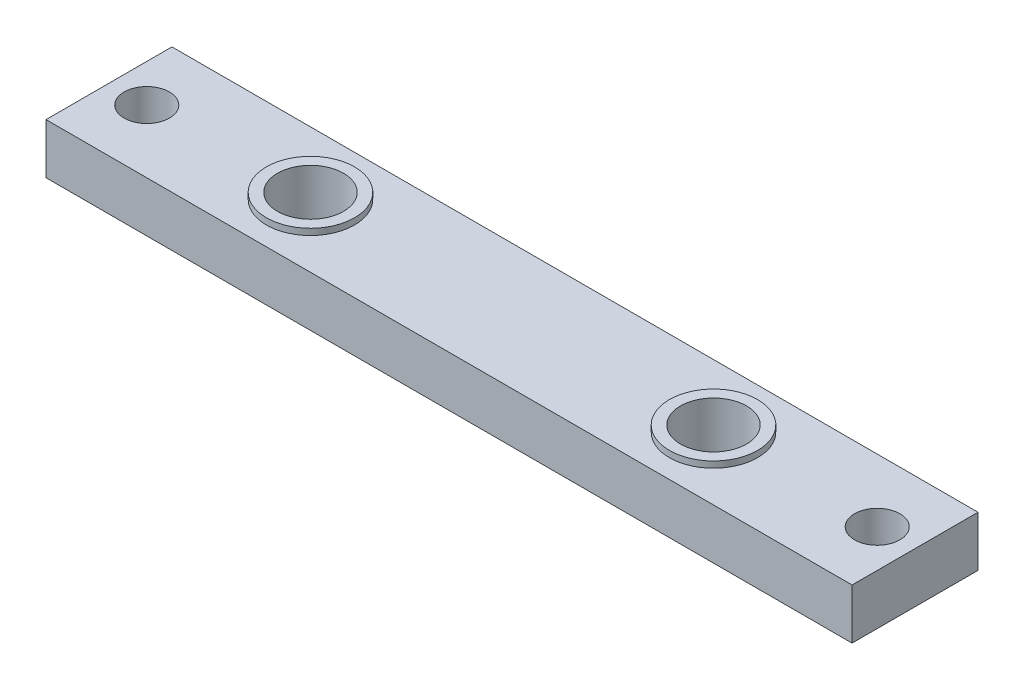
ISO-10303-21;
HEADER;
FILE_DESCRIPTION(('STEP AP214'),'2;1');
FILE_NAME('part.step','',(''),(''),'','','');
FILE_SCHEMA(('AUTOMOTIVE_DESIGN { 1 0 10303 214 1 1 1 1 }'));
ENDSEC;
DATA;
#1=APPLICATION_CONTEXT('core data for automotive mechanical design processes');
#2=APPLICATION_PROTOCOL_DEFINITION('international standard','automotive_design',2000,#1);
#3=PRODUCT_CONTEXT('',#1,'mechanical');
#4=PRODUCT('Part','Part','',(#3));
#5=PRODUCT_RELATED_PRODUCT_CATEGORY('part','',(#4));
#6=PRODUCT_DEFINITION_FORMATION('','',#4);
#7=PRODUCT_DEFINITION_CONTEXT('part definition',#1,'design');
#8=PRODUCT_DEFINITION('design','',#6,#7);
#9=PRODUCT_DEFINITION_SHAPE('','',#8);
#10=(LENGTH_UNIT() NAMED_UNIT(*) SI_UNIT(.MILLI.,.METRE.));
#11=(NAMED_UNIT(*) PLANE_ANGLE_UNIT() SI_UNIT($,.RADIAN.));
#12=(NAMED_UNIT(*) SI_UNIT($,.STERADIAN.) SOLID_ANGLE_UNIT());
#13=UNCERTAINTY_MEASURE_WITH_UNIT(LENGTH_MEASURE(1.E-05),#10,'distance_accuracy_value','');
#14=(GEOMETRIC_REPRESENTATION_CONTEXT(3) GLOBAL_UNCERTAINTY_ASSIGNED_CONTEXT((#13)) GLOBAL_UNIT_ASSIGNED_CONTEXT((#10,
#11,#12)) REPRESENTATION_CONTEXT('',''));
#15=CARTESIAN_POINT('',(0.,0.,0.));
#16=DIRECTION('',(0.,0.,1.));
#17=DIRECTION('',(1.,0.,0.));
#18=AXIS2_PLACEMENT_3D('',#15,#16,#17);
#19=CARTESIAN_POINT('',(0.,4.,0.));
#20=DIRECTION('',(0.,-1.,0.));
#21=DIRECTION('',(0.,0.,-1.));
#22=AXIS2_PLACEMENT_3D('',#19,#20,#21);
#23=PLANE('',#22);
#24=CARTESIAN_POINT('',(48.,4.,-5.));
#25=DIRECTION('',(0.,-1.,0.));
#26=DIRECTION('',(0.,0.,-1.));
#27=AXIS2_PLACEMENT_3D('',#24,#25,#26);
#28=CIRCLE('',#27,3.5);
#29=CARTESIAN_POINT('',(48.,4.,-8.5));
#30=VERTEX_POINT('',#29);
#31=EDGE_CURVE('E248',#30,#30,#28,.T.);
#32=ORIENTED_EDGE('',*,*,#31,.T.);
#33=EDGE_LOOP('',(#32));
#34=FACE_BOUND('',#33,.T.);
#35=CARTESIAN_POINT('',(16.,4.,-5.));
#36=DIRECTION('',(0.,-1.,0.));
#37=DIRECTION('',(0.,0.,-1.));
#38=AXIS2_PLACEMENT_3D('',#35,#36,#37);
#39=CIRCLE('',#38,3.5);
#40=CARTESIAN_POINT('',(16.,4.,-8.5));
#41=VERTEX_POINT('',#40);
#42=EDGE_CURVE('E237',#41,#41,#39,.T.);
#43=ORIENTED_EDGE('',*,*,#42,.T.);
#44=EDGE_LOOP('',(#43));
#45=FACE_BOUND('',#44,.T.);
#46=CARTESIAN_POINT('',(61.,4.,-5.));
#47=DIRECTION('',(0.,-1.,0.));
#48=DIRECTION('',(0.,0.,-1.));
#49=AXIS2_PLACEMENT_3D('',#46,#47,#48);
#50=CIRCLE('',#49,1.8);
#51=CARTESIAN_POINT('',(61.,4.,-6.8));
#52=VERTEX_POINT('',#51);
#53=EDGE_CURVE('E225',#52,#52,#50,.T.);
#54=ORIENTED_EDGE('',*,*,#53,.T.);
#55=EDGE_LOOP('',(#54));
#56=FACE_BOUND('',#55,.T.);
#57=DIRECTION('',(0.,0.,-1.));
#58=VECTOR('',#57,1.);
#59=CARTESIAN_POINT('',(0.,4.,0.));
#60=LINE('',#59,#58);
#61=CARTESIAN_POINT('',(0.,4.,0.));
#62=VERTEX_POINT('',#61);
#63=CARTESIAN_POINT('',(0.,4.,-10.));
#64=VERTEX_POINT('',#63);
#65=EDGE_CURVE('E166',#62,#64,#60,.T.);
#66=ORIENTED_EDGE('',*,*,#65,.F.);
#67=DIRECTION('',(1.,0.,0.));
#68=VECTOR('',#67,1.);
#69=CARTESIAN_POINT('',(0.,4.,0.));
#70=LINE('',#69,#68);
#71=CARTESIAN_POINT('',(64.,4.,0.));
#72=VERTEX_POINT('',#71);
#73=EDGE_CURVE('E156',#62,#72,#70,.T.);
#74=ORIENTED_EDGE('',*,*,#73,.T.);
#75=DIRECTION('',(0.,0.,-1.));
#76=VECTOR('',#75,1.);
#77=CARTESIAN_POINT('',(64.,4.,0.));
#78=LINE('',#77,#76);
#79=CARTESIAN_POINT('',(64.,4.,-10.));
#80=VERTEX_POINT('',#79);
#81=EDGE_CURVE('E151',#72,#80,#78,.T.);
#82=ORIENTED_EDGE('',*,*,#81,.T.);
#83=DIRECTION('',(1.,0.,0.));
#84=VECTOR('',#83,1.);
#85=CARTESIAN_POINT('',(0.,4.,-10.));
#86=LINE('',#85,#84);
#87=EDGE_CURVE('E155',#64,#80,#86,.T.);
#88=ORIENTED_EDGE('',*,*,#87,.F.);
#89=EDGE_LOOP('',(#66,#74,#82,#88));
#90=FACE_BOUND('',#89,.T.);
#91=CARTESIAN_POINT('',(3.,4.,-5.));
#92=DIRECTION('',(0.,1.,0.));
#93=DIRECTION('',(0.,0.,1.));
#94=AXIS2_PLACEMENT_3D('',#91,#92,#93);
#95=CIRCLE('',#94,1.8);
#96=CARTESIAN_POINT('',(3.,4.,-3.2));
#97=VERTEX_POINT('',#96);
#98=EDGE_CURVE('E176',#97,#97,#95,.T.);
#99=ORIENTED_EDGE('',*,*,#98,.F.);
#100=EDGE_LOOP('',(#99));
#101=FACE_BOUND('',#100,.T.);
#102=ADVANCED_FACE('F105',(#34,#45,#56,#90,#101),#23,.F.);
#103=CARTESIAN_POINT('',(0.,0.,0.));
#104=DIRECTION('',(0.,-1.,0.));
#105=DIRECTION('',(0.,0.,-1.));
#106=AXIS2_PLACEMENT_3D('',#103,#104,#105);
#107=PLANE('',#106);
#108=CARTESIAN_POINT('',(48.,0.,-5.));
#109=DIRECTION('',(0.,-1.,0.));
#110=DIRECTION('',(0.,0.,-1.));
#111=AXIS2_PLACEMENT_3D('',#108,#109,#110);
#112=CIRCLE('',#111,2.625);
#113=CARTESIAN_POINT('',(48.,0.,-7.625));
#114=VERTEX_POINT('',#113);
#115=EDGE_CURVE('E231',#114,#114,#112,.T.);
#116=ORIENTED_EDGE('',*,*,#115,.F.);
#117=EDGE_LOOP('',(#116));
#118=FACE_BOUND('',#117,.T.);
#119=CARTESIAN_POINT('',(61.,0.,-5.));
#120=DIRECTION('',(0.,-1.,0.));
#121=DIRECTION('',(0.,0.,-1.));
#122=AXIS2_PLACEMENT_3D('',#119,#120,#121);
#123=CIRCLE('',#122,1.8);
#124=CARTESIAN_POINT('',(61.,0.,-6.8));
#125=VERTEX_POINT('',#124);
#126=EDGE_CURVE('E228',#125,#125,#123,.T.);
#127=ORIENTED_EDGE('',*,*,#126,.F.);
#128=EDGE_LOOP('',(#127));
#129=FACE_BOUND('',#128,.T.);
#130=CARTESIAN_POINT('',(3.,0.,-5.));
#131=DIRECTION('',(0.,1.,0.));
#132=DIRECTION('',(0.,0.,1.));
#133=AXIS2_PLACEMENT_3D('',#130,#131,#132);
#134=CIRCLE('',#133,1.8);
#135=CARTESIAN_POINT('',(3.,0.,-3.2));
#136=VERTEX_POINT('',#135);
#137=EDGE_CURVE('E220',#136,#136,#134,.T.);
#138=ORIENTED_EDGE('',*,*,#137,.T.);
#139=EDGE_LOOP('',(#138));
#140=FACE_BOUND('',#139,.T.);
#141=DIRECTION('',(0.,0.,-1.));
#142=VECTOR('',#141,1.);
#143=CARTESIAN_POINT('',(0.,0.,0.));
#144=LINE('',#143,#142);
#145=CARTESIAN_POINT('',(0.,0.,0.));
#146=VERTEX_POINT('',#145);
#147=CARTESIAN_POINT('',(0.,0.,-10.));
#148=VERTEX_POINT('',#147);
#149=EDGE_CURVE('E172',#146,#148,#144,.T.);
#150=ORIENTED_EDGE('',*,*,#149,.T.);
#151=DIRECTION('',(1.,0.,0.));
#152=VECTOR('',#151,1.);
#153=CARTESIAN_POINT('',(0.,0.,-10.));
#154=LINE('',#153,#152);
#155=CARTESIAN_POINT('',(64.,0.,-10.));
#156=VERTEX_POINT('',#155);
#157=EDGE_CURVE('E175',#148,#156,#154,.T.);
#158=ORIENTED_EDGE('',*,*,#157,.T.);
#159=DIRECTION('',(0.,0.,-1.));
#160=VECTOR('',#159,1.);
#161=CARTESIAN_POINT('',(64.,0.,0.));
#162=LINE('',#161,#160);
#163=CARTESIAN_POINT('',(64.,0.,0.));
#164=VERTEX_POINT('',#163);
#165=EDGE_CURVE('E163',#164,#156,#162,.T.);
#166=ORIENTED_EDGE('',*,*,#165,.F.);
#167=DIRECTION('',(1.,0.,0.));
#168=VECTOR('',#167,1.);
#169=CARTESIAN_POINT('',(0.,0.,0.));
#170=LINE('',#169,#168);
#171=EDGE_CURVE('E139',#146,#164,#170,.T.);
#172=ORIENTED_EDGE('',*,*,#171,.F.);
#173=EDGE_LOOP('',(#150,#158,#166,#172));
#174=FACE_BOUND('',#173,.T.);
#175=CARTESIAN_POINT('',(16.,0.,-5.));
#176=DIRECTION('',(0.,1.,0.));
#177=DIRECTION('',(0.,0.,1.));
#178=AXIS2_PLACEMENT_3D('',#175,#176,#177);
#179=CIRCLE('',#178,2.625);
#180=CARTESIAN_POINT('',(16.,0.,-2.375));
#181=VERTEX_POINT('',#180);
#182=EDGE_CURVE('E222',#181,#181,#179,.T.);
#183=ORIENTED_EDGE('',*,*,#182,.T.);
#184=EDGE_LOOP('',(#183));
#185=FACE_BOUND('',#184,.T.);
#186=ADVANCED_FACE('F181',(#118,#129,#140,#174,#185),#107,.T.);
#187=CARTESIAN_POINT('',(0.,4.,0.));
#188=DIRECTION('',(-1.,0.,0.));
#189=DIRECTION('',(0.,0.,1.));
#190=AXIS2_PLACEMENT_3D('',#187,#188,#189);
#191=PLANE('',#190);
#192=ORIENTED_EDGE('',*,*,#149,.F.);
#193=DIRECTION('',(0.,-1.,0.));
#194=VECTOR('',#193,1.);
#195=CARTESIAN_POINT('',(0.,4.,0.));
#196=LINE('',#195,#194);
#197=EDGE_CURVE('E12',#62,#146,#196,.T.);
#198=ORIENTED_EDGE('',*,*,#197,.F.);
#199=ORIENTED_EDGE('',*,*,#65,.T.);
#200=DIRECTION('',(0.,-1.,0.));
#201=VECTOR('',#200,1.);
#202=CARTESIAN_POINT('',(0.,4.,-10.));
#203=LINE('',#202,#201);
#204=EDGE_CURVE('E109',#64,#148,#203,.T.);
#205=ORIENTED_EDGE('',*,*,#204,.T.);
#206=EDGE_LOOP('',(#192,#198,#199,#205));
#207=FACE_BOUND('',#206,.T.);
#208=ADVANCED_FACE('F107',(#207),#191,.T.);
#209=CARTESIAN_POINT('',(0.,4.,0.));
#210=DIRECTION('',(0.,0.,-1.));
#211=DIRECTION('',(-1.,0.,0.));
#212=AXIS2_PLACEMENT_3D('',#209,#210,#211);
#213=PLANE('',#212);
#214=ORIENTED_EDGE('',*,*,#171,.T.);
#215=DIRECTION('',(0.,-1.,0.));
#216=VECTOR('',#215,1.);
#217=CARTESIAN_POINT('',(64.,4.,0.));
#218=LINE('',#217,#216);
#219=EDGE_CURVE('E115',#72,#164,#218,.T.);
#220=ORIENTED_EDGE('',*,*,#219,.F.);
#221=ORIENTED_EDGE('',*,*,#73,.F.);
#222=ORIENTED_EDGE('',*,*,#197,.T.);
#223=EDGE_LOOP('',(#214,#220,#221,#222));
#224=FACE_BOUND('',#223,.T.);
#225=ADVANCED_FACE('F184',(#224),#213,.F.);
#226=CARTESIAN_POINT('',(64.,4.,0.));
#227=DIRECTION('',(-1.,0.,0.));
#228=DIRECTION('',(0.,0.,1.));
#229=AXIS2_PLACEMENT_3D('',#226,#227,#228);
#230=PLANE('',#229);
#231=ORIENTED_EDGE('',*,*,#165,.T.);
#232=DIRECTION('',(0.,-1.,0.));
#233=VECTOR('',#232,1.);
#234=CARTESIAN_POINT('',(64.,4.,-10.));
#235=LINE('',#234,#233);
#236=EDGE_CURVE('E160',#80,#156,#235,.T.);
#237=ORIENTED_EDGE('',*,*,#236,.F.);
#238=ORIENTED_EDGE('',*,*,#81,.F.);
#239=ORIENTED_EDGE('',*,*,#219,.T.);
#240=EDGE_LOOP('',(#231,#237,#238,#239));
#241=FACE_BOUND('',#240,.T.);
#242=ADVANCED_FACE('F161',(#241),#230,.F.);
#243=CARTESIAN_POINT('',(0.,4.,-10.));
#244=DIRECTION('',(0.,0.,-1.));
#245=DIRECTION('',(-1.,0.,0.));
#246=AXIS2_PLACEMENT_3D('',#243,#244,#245);
#247=PLANE('',#246);
#248=ORIENTED_EDGE('',*,*,#157,.F.);
#249=ORIENTED_EDGE('',*,*,#204,.F.);
#250=ORIENTED_EDGE('',*,*,#87,.T.);
#251=ORIENTED_EDGE('',*,*,#236,.T.);
#252=EDGE_LOOP('',(#248,#249,#250,#251));
#253=FACE_BOUND('',#252,.T.);
#254=ADVANCED_FACE('F165',(#253),#247,.T.);
#255=CARTESIAN_POINT('',(3.,4.,-5.));
#256=DIRECTION('',(0.,-1.,0.));
#257=DIRECTION('',(0.,0.,-1.));
#258=AXIS2_PLACEMENT_3D('',#255,#256,#257);
#259=CYLINDRICAL_SURFACE('',#258,1.8);
#260=ORIENTED_EDGE('',*,*,#98,.T.);
#261=EDGE_LOOP('',(#260));
#262=FACE_BOUND('',#261,.T.);
#263=ORIENTED_EDGE('',*,*,#137,.F.);
#264=EDGE_LOOP('',(#263));
#265=FACE_BOUND('',#264,.T.);
#266=ADVANCED_FACE('F200',(#262,#265),#259,.F.);
#267=CARTESIAN_POINT('',(16.,4.,-5.));
#268=DIRECTION('',(0.,-1.,0.));
#269=DIRECTION('',(0.,0.,-1.));
#270=AXIS2_PLACEMENT_3D('',#267,#268,#269);
#271=CYLINDRICAL_SURFACE('',#270,2.625);
#272=ORIENTED_EDGE('',*,*,#182,.F.);
#273=EDGE_LOOP('',(#272));
#274=FACE_BOUND('',#273,.T.);
#275=CARTESIAN_POINT('',(16.,4.5,-5.));
#276=DIRECTION('',(0.,-1.,0.));
#277=DIRECTION('',(0.,0.,-1.));
#278=AXIS2_PLACEMENT_3D('',#275,#276,#277);
#279=CIRCLE('',#278,2.625);
#280=CARTESIAN_POINT('',(16.,4.5,-7.625));
#281=VERTEX_POINT('',#280);
#282=EDGE_CURVE('E240',#281,#281,#279,.T.);
#283=ORIENTED_EDGE('',*,*,#282,.F.);
#284=EDGE_LOOP('',(#283));
#285=FACE_BOUND('',#284,.T.);
#286=ADVANCED_FACE('F208',(#274,#285),#271,.F.);
#287=CARTESIAN_POINT('',(61.,4.,-5.));
#288=DIRECTION('',(0.,-1.,0.));
#289=DIRECTION('',(0.,0.,-1.));
#290=AXIS2_PLACEMENT_3D('',#287,#288,#289);
#291=CYLINDRICAL_SURFACE('',#290,1.8);
#292=ORIENTED_EDGE('',*,*,#53,.F.);
#293=EDGE_LOOP('',(#292));
#294=FACE_BOUND('',#293,.T.);
#295=ORIENTED_EDGE('',*,*,#126,.T.);
#296=EDGE_LOOP('',(#295));
#297=FACE_BOUND('',#296,.T.);
#298=ADVANCED_FACE('F213',(#294,#297),#291,.F.);
#299=CARTESIAN_POINT('',(48.,4.,-5.));
#300=DIRECTION('',(0.,-1.,0.));
#301=DIRECTION('',(0.,0.,-1.));
#302=AXIS2_PLACEMENT_3D('',#299,#300,#301);
#303=CYLINDRICAL_SURFACE('',#302,2.625);
#304=ORIENTED_EDGE('',*,*,#115,.T.);
#305=EDGE_LOOP('',(#304));
#306=FACE_BOUND('',#305,.T.);
#307=CARTESIAN_POINT('',(48.,4.5,-5.));
#308=DIRECTION('',(0.,-1.,0.));
#309=DIRECTION('',(0.,0.,-1.));
#310=AXIS2_PLACEMENT_3D('',#307,#308,#309);
#311=CIRCLE('',#310,2.625);
#312=CARTESIAN_POINT('',(48.,4.5,-7.625));
#313=VERTEX_POINT('',#312);
#314=EDGE_CURVE('E245',#313,#313,#311,.T.);
#315=ORIENTED_EDGE('',*,*,#314,.F.);
#316=EDGE_LOOP('',(#315));
#317=FACE_BOUND('',#316,.T.);
#318=ADVANCED_FACE('F272',(#306,#317),#303,.F.);
#319=CARTESIAN_POINT('',(16.,4.5,-5.));
#320=DIRECTION('',(0.,-1.,0.));
#321=DIRECTION('',(0.,0.,-1.));
#322=AXIS2_PLACEMENT_3D('',#319,#320,#321);
#323=CYLINDRICAL_SURFACE('',#322,3.5);
#324=CARTESIAN_POINT('',(16.,4.5,-5.));
#325=DIRECTION('',(0.,-1.,0.));
#326=DIRECTION('',(0.,0.,-1.));
#327=AXIS2_PLACEMENT_3D('',#324,#325,#326);
#328=CIRCLE('',#327,3.5);
#329=CARTESIAN_POINT('',(16.,4.5,-8.5));
#330=VERTEX_POINT('',#329);
#331=EDGE_CURVE('E236',#330,#330,#328,.T.);
#332=ORIENTED_EDGE('',*,*,#331,.T.);
#333=EDGE_LOOP('',(#332));
#334=FACE_BOUND('',#333,.T.);
#335=ORIENTED_EDGE('',*,*,#42,.F.);
#336=EDGE_LOOP('',(#335));
#337=FACE_BOUND('',#336,.T.);
#338=ADVANCED_FACE('F266',(#334,#337),#323,.T.);
#339=CARTESIAN_POINT('',(16.,4.5,-5.));
#340=DIRECTION('',(0.,-1.,0.));
#341=DIRECTION('',(0.,0.,-1.));
#342=AXIS2_PLACEMENT_3D('',#339,#340,#341);
#343=PLANE('',#342);
#344=ORIENTED_EDGE('',*,*,#282,.T.);
#345=EDGE_LOOP('',(#344));
#346=FACE_BOUND('',#345,.T.);
#347=ORIENTED_EDGE('',*,*,#331,.F.);
#348=EDGE_LOOP('',(#347));
#349=FACE_BOUND('',#348,.T.);
#350=ADVANCED_FACE('F257',(#346,#349),#343,.F.);
#351=CARTESIAN_POINT('',(48.,4.5,-5.));
#352=DIRECTION('',(0.,-1.,0.));
#353=DIRECTION('',(0.,0.,-1.));
#354=AXIS2_PLACEMENT_3D('',#351,#352,#353);
#355=CYLINDRICAL_SURFACE('',#354,3.5);
#356=CARTESIAN_POINT('',(48.,4.5,-5.));
#357=DIRECTION('',(0.,-1.,0.));
#358=DIRECTION('',(0.,0.,-1.));
#359=AXIS2_PLACEMENT_3D('',#356,#357,#358);
#360=CIRCLE('',#359,3.5);
#361=CARTESIAN_POINT('',(48.,4.5,-8.5));
#362=VERTEX_POINT('',#361);
#363=EDGE_CURVE('E249',#362,#362,#360,.T.);
#364=ORIENTED_EDGE('',*,*,#363,.T.);
#365=EDGE_LOOP('',(#364));
#366=FACE_BOUND('',#365,.T.);
#367=ORIENTED_EDGE('',*,*,#31,.F.);
#368=EDGE_LOOP('',(#367));
#369=FACE_BOUND('',#368,.T.);
#370=ADVANCED_FACE('F254',(#366,#369),#355,.T.);
#371=CARTESIAN_POINT('',(48.,4.5,-5.));
#372=DIRECTION('',(0.,-1.,0.));
#373=DIRECTION('',(0.,0.,-1.));
#374=AXIS2_PLACEMENT_3D('',#371,#372,#373);
#375=PLANE('',#374);
#376=ORIENTED_EDGE('',*,*,#314,.T.);
#377=EDGE_LOOP('',(#376));
#378=FACE_BOUND('',#377,.T.);
#379=ORIENTED_EDGE('',*,*,#363,.F.);
#380=EDGE_LOOP('',(#379));
#381=FACE_BOUND('',#380,.T.);
#382=ADVANCED_FACE('F256',(#378,#381),#375,.F.);
#383=CLOSED_SHELL('',(#102,#186,#208,#225,#242,#254,#266,#286,#298,#318,#338,#350,#370,#382));
#384=MANIFOLD_SOLID_BREP('B2',#383);
#385=ADVANCED_BREP_SHAPE_REPRESENTATION('',(#18,#384),#14);
#386=SHAPE_DEFINITION_REPRESENTATION(#9,#385);
ENDSEC;
END-ISO-10303-21;
